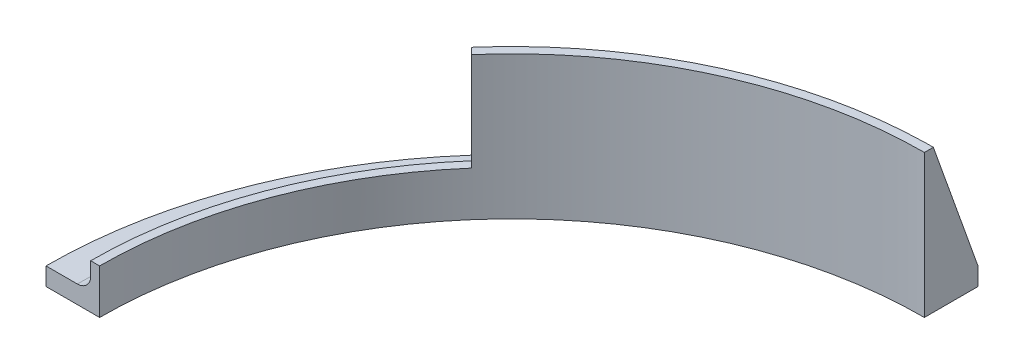
ISO-10303-21;
HEADER;
FILE_DESCRIPTION(('STEP AP214'),'2;1');
FILE_NAME('part.step','',(''),(''),'','','');
FILE_SCHEMA(('AUTOMOTIVE_DESIGN { 1 0 10303 214 1 1 1 1 }'));
ENDSEC;
DATA;
#1=APPLICATION_CONTEXT('core data for automotive mechanical design processes');
#2=APPLICATION_PROTOCOL_DEFINITION('international standard','automotive_design',2000,#1);
#3=PRODUCT_CONTEXT('',#1,'mechanical');
#4=PRODUCT('Part','Part','',(#3));
#5=PRODUCT_RELATED_PRODUCT_CATEGORY('part','',(#4));
#6=PRODUCT_DEFINITION_FORMATION('','',#4);
#7=PRODUCT_DEFINITION_CONTEXT('part definition',#1,'design');
#8=PRODUCT_DEFINITION('design','',#6,#7);
#9=PRODUCT_DEFINITION_SHAPE('','',#8);
#10=(LENGTH_UNIT() NAMED_UNIT(*) SI_UNIT(.MILLI.,.METRE.));
#11=(NAMED_UNIT(*) PLANE_ANGLE_UNIT() SI_UNIT($,.RADIAN.));
#12=(NAMED_UNIT(*) SI_UNIT($,.STERADIAN.) SOLID_ANGLE_UNIT());
#13=UNCERTAINTY_MEASURE_WITH_UNIT(LENGTH_MEASURE(1.E-05),#10,'distance_accuracy_value','');
#14=(GEOMETRIC_REPRESENTATION_CONTEXT(3) GLOBAL_UNCERTAINTY_ASSIGNED_CONTEXT((#13)) GLOBAL_UNIT_ASSIGNED_CONTEXT((#10,
#11,#12)) REPRESENTATION_CONTEXT('',''));
#15=CARTESIAN_POINT('',(0.,0.,0.));
#16=DIRECTION('',(0.,0.,1.));
#17=DIRECTION('',(1.,0.,0.));
#18=AXIS2_PLACEMENT_3D('',#15,#16,#17);
#19=CARTESIAN_POINT('',(0.,6.35,0.));
#20=DIRECTION('',(0.,1.,0.));
#21=DIRECTION('',(0.,0.,1.));
#22=AXIS2_PLACEMENT_3D('',#19,#20,#21);
#23=PLANE('',#22);
#24=CARTESIAN_POINT('',(-143.383000088422,6.35,-65.5843110499279));
#25=DIRECTION('',(0.,1.,0.));
#26=DIRECTION('',(0.,0.,1.));
#27=AXIS2_PLACEMENT_3D('',#24,#25,#26);
#28=CIRCLE('',#27,2.0193);
#29=CARTESIAN_POINT('',(-143.383000088422,6.35,-63.5650110499279));
#30=VERTEX_POINT('',#29);
#31=EDGE_CURVE('E246',#30,#30,#28,.T.);
#32=ORIENTED_EDGE('',*,*,#31,.F.);
#33=EDGE_LOOP('',(#32));
#34=FACE_BOUND('',#33,.T.);
#35=DIRECTION('',(-1.,0.,0.));
#36=VECTOR('',#35,1.);
#37=CARTESIAN_POINT('',(-146.558,6.35,0.));
#38=LINE('',#37,#36);
#39=CARTESIAN_POINT('',(-154.4955,6.35,0.));
#40=VERTEX_POINT('',#39);
#41=CARTESIAN_POINT('',(-165.608,6.35,0.));
#42=VERTEX_POINT('',#41);
#43=EDGE_CURVE('E285',#40,#42,#38,.T.);
#44=ORIENTED_EDGE('',*,*,#43,.F.);
#45=CARTESIAN_POINT('',(0.,6.35,0.));
#46=DIRECTION('',(0.,1.,0.));
#47=DIRECTION('',(0.,0.,1.));
#48=AXIS2_PLACEMENT_3D('',#45,#46,#47);
#49=CIRCLE('',#48,154.4955);
#50=CARTESIAN_POINT('',(-115.80414073816,6.35,-102.265636985971));
#51=VERTEX_POINT('',#50);
#52=EDGE_CURVE('E318',#40,#51,#49,.F.);
#53=ORIENTED_EDGE('',*,*,#52,.T.);
#54=DIRECTION('',(-0.735801674200395,0.,-0.677197088183267));
#55=VECTOR('',#54,1.);
#56=CARTESIAN_POINT('',(-109.987722522443,6.35,-96.9124805343771));
#57=LINE('',#56,#55);
#58=CARTESIAN_POINT('',(-123.982348087126,6.35,-109.792472541622));
#59=VERTEX_POINT('',#58);
#60=EDGE_CURVE('E186',#51,#59,#57,.T.);
#61=ORIENTED_EDGE('',*,*,#60,.T.);
#62=CARTESIAN_POINT('',(0.,6.35,0.));
#63=DIRECTION('',(0.,1.,0.));
#64=DIRECTION('',(0.,0.,1.));
#65=AXIS2_PLACEMENT_3D('',#62,#63,#64);
#66=CIRCLE('',#65,165.608);
#67=EDGE_CURVE('E287',#59,#42,#66,.T.);
#68=ORIENTED_EDGE('',*,*,#67,.T.);
#69=EDGE_LOOP('',(#44,#53,#61,#68));
#70=FACE_BOUND('',#69,.T.);
#71=ADVANCED_FACE('F61',(#34,#70),#23,.T.);
#72=CARTESIAN_POINT('',(0.,50.8,0.));
#73=DIRECTION('',(0.,-1.,0.));
#74=DIRECTION('',(0.,0.,-1.));
#75=AXIS2_PLACEMENT_3D('',#72,#73,#74);
#76=CYLINDRICAL_SURFACE('',#75,149.733);
#77=DIRECTION('',(0.,-1.,0.));
#78=VECTOR('',#77,1.);
#79=CARTESIAN_POINT('',(-112.299121496045,50.8,-99.0397829168485));
#80=LINE('',#79,#78);
#81=CARTESIAN_POINT('',(-112.299121496045,11.1125,-99.0397829168485));
#82=VERTEX_POINT('',#81);
#83=CARTESIAN_POINT('',(-112.299121496045,50.8,-99.0397829168485));
#84=VERTEX_POINT('',#83);
#85=EDGE_CURVE('E210',#82,#84,#80,.F.);
#86=ORIENTED_EDGE('',*,*,#85,.F.);
#87=CARTESIAN_POINT('',(0.,11.1125,0.));
#88=DIRECTION('',(0.,1.,0.));
#89=DIRECTION('',(0.,0.,1.));
#90=AXIS2_PLACEMENT_3D('',#87,#88,#89);
#91=CIRCLE('',#90,149.733);
#92=CARTESIAN_POINT('',(-149.733,11.1125,0.));
#93=VERTEX_POINT('',#92);
#94=EDGE_CURVE('E315',#82,#93,#91,.T.);
#95=ORIENTED_EDGE('',*,*,#94,.T.);
#96=DIRECTION('',(0.,-1.,0.));
#97=VECTOR('',#96,1.);
#98=CARTESIAN_POINT('',(-149.733,50.8,0.));
#99=LINE('',#98,#97);
#100=CARTESIAN_POINT('',(-149.733,15.875,0.));
#101=VERTEX_POINT('',#100);
#102=EDGE_CURVE('E278',#101,#93,#99,.T.);
#103=ORIENTED_EDGE('',*,*,#102,.F.);
#104=CARTESIAN_POINT('',(0.,15.875,0.));
#105=DIRECTION('',(0.,1.,0.));
#106=DIRECTION('',(0.,0.,1.));
#107=AXIS2_PLACEMENT_3D('',#104,#105,#106);
#108=CIRCLE('',#107,149.733);
#109=CARTESIAN_POINT('',(-112.817404434217,15.875,-98.448994640506));
#110=VERTEX_POINT('',#109);
#111=EDGE_CURVE('E253',#101,#110,#108,.F.);
#112=ORIENTED_EDGE('',*,*,#111,.T.);
#113=DIRECTION('',(0.,1.,0.));
#114=VECTOR('',#113,1.);
#115=CARTESIAN_POINT('',(-112.817404434217,-99.6036542990722,-98.448994640506));
#116=LINE('',#115,#114);
#117=CARTESIAN_POINT('',(-112.817404434217,50.8,-98.448994640506));
#118=VERTEX_POINT('',#117);
#119=EDGE_CURVE('E257',#110,#118,#116,.T.);
#120=ORIENTED_EDGE('',*,*,#119,.T.);
#121=CARTESIAN_POINT('',(0.,50.8,0.));
#122=DIRECTION('',(0.,1.,0.));
#123=DIRECTION('',(0.,0.,-1.));
#124=AXIS2_PLACEMENT_3D('',#121,#122,#123);
#125=CIRCLE('',#124,149.733);
#126=EDGE_CURVE('E273',#84,#118,#125,.T.);
#127=ORIENTED_EDGE('',*,*,#126,.F.);
#128=EDGE_LOOP('',(#86,#95,#103,#112,#120,#127));
#129=FACE_BOUND('',#128,.T.);
#130=ADVANCED_FACE('F386',(#129),#76,.T.);
#131=DIRECTION('',(-0.735801674200395,0.,-0.677197088183267));
#132=VECTOR('',#131,1.);
#133=CARTESIAN_POINT('',(-107.837621767461,6.35,-99.2486508499633));
#134=LINE('',#133,#132);
#135=CARTESIAN_POINT('',(-113.678047556427,6.35,-104.623902737418));
#136=VERTEX_POINT('',#135);
#137=CARTESIAN_POINT('',(-121.854643660979,6.35,-112.149255379855));
#138=VERTEX_POINT('',#137);
#139=EDGE_CURVE('E204',#136,#138,#134,.T.);
#140=ORIENTED_EDGE('',*,*,#139,.F.);
#141=CARTESIAN_POINT('',(0.,6.35,0.));
#142=DIRECTION('',(0.,1.,0.));
#143=DIRECTION('',(0.,0.,1.));
#144=AXIS2_PLACEMENT_3D('',#141,#142,#143);
#145=CIRCLE('',#144,154.4955);
#146=CARTESIAN_POINT('',(-3.175,6.35,-154.462872222583));
#147=VERTEX_POINT('',#146);
#148=EDGE_CURVE('E77',#136,#147,#145,.F.);
#149=ORIENTED_EDGE('',*,*,#148,.T.);
#150=DIRECTION('',(0.,0.,-1.));
#151=VECTOR('',#150,1.);
#152=CARTESIAN_POINT('',(-3.175,6.35,-146.558));
#153=LINE('',#152,#151);
#154=CARTESIAN_POINT('',(-3.175,6.35,-165.577562003431));
#155=VERTEX_POINT('',#154);
#156=EDGE_CURVE('E219',#147,#155,#153,.T.);
#157=ORIENTED_EDGE('',*,*,#156,.T.);
#158=EDGE_CURVE('E286',#155,#138,#66,.T.);
#159=ORIENTED_EDGE('',*,*,#158,.T.);
#160=EDGE_LOOP('',(#140,#149,#157,#159));
#161=FACE_BOUND('',#160,.T.);
#162=CARTESIAN_POINT('',(-6.35,6.35,-157.542578594645));
#163=DIRECTION('',(0.,1.,0.));
#164=DIRECTION('',(0.,0.,1.));
#165=AXIS2_PLACEMENT_3D('',#162,#163,#164);
#166=CIRCLE('',#165,2.01929999999999);
#167=CARTESIAN_POINT('',(-6.35,6.35,-155.523278594645));
#168=VERTEX_POINT('',#167);
#169=EDGE_CURVE('E233',#168,#168,#166,.T.);
#170=ORIENTED_EDGE('',*,*,#169,.F.);
#171=EDGE_LOOP('',(#170));
#172=FACE_BOUND('',#171,.T.);
#173=CARTESIAN_POINT('',(-87.8582584127768,6.35,-130.923309608808));
#174=DIRECTION('',(0.,1.,0.));
#175=DIRECTION('',(0.,0.,1.));
#176=AXIS2_PLACEMENT_3D('',#173,#174,#175);
#177=CIRCLE('',#176,2.01929999999999);
#178=CARTESIAN_POINT('',(-87.8582584127768,6.35,-128.904009608808));
#179=VERTEX_POINT('',#178);
#180=EDGE_CURVE('E240',#179,#179,#177,.T.);
#181=ORIENTED_EDGE('',*,*,#180,.F.);
#182=EDGE_LOOP('',(#181));
#183=FACE_BOUND('',#182,.T.);
#184=ADVANCED_FACE('F371',(#161,#172,#183),#23,.T.);
#185=DIRECTION('',(0.,-1.,0.));
#186=VECTOR('',#185,1.);
#187=CARTESIAN_POINT('',(-3.175,50.8,-149.699334213616));
#188=LINE('',#187,#186);
#189=CARTESIAN_POINT('',(-3.175,11.1125,-149.699334213616));
#190=VERTEX_POINT('',#189);
#191=CARTESIAN_POINT('',(-3.175,50.8,-149.699334213616));
#192=VERTEX_POINT('',#191);
#193=EDGE_CURVE('E229',#190,#192,#188,.F.);
#194=ORIENTED_EDGE('',*,*,#193,.F.);
#195=CARTESIAN_POINT('',(0.,11.1125,0.));
#196=DIRECTION('',(0.,1.,0.));
#197=DIRECTION('',(0.,0.,1.));
#198=AXIS2_PLACEMENT_3D('',#195,#196,#197);
#199=CIRCLE('',#198,149.733);
#200=CARTESIAN_POINT('',(-110.173792083048,11.1125,-101.398751604945));
#201=VERTEX_POINT('',#200);
#202=EDGE_CURVE('E327',#190,#201,#199,.T.);
#203=ORIENTED_EDGE('',*,*,#202,.T.);
#204=DIRECTION('',(0.,-1.,0.));
#205=VECTOR('',#204,1.);
#206=CARTESIAN_POINT('',(-110.173792083048,50.8,-101.398751604945));
#207=LINE('',#206,#205);
#208=CARTESIAN_POINT('',(-110.173792083048,50.8,-101.398751604945));
#209=VERTEX_POINT('',#208);
#210=EDGE_CURVE('E207',#201,#209,#207,.F.);
#211=ORIENTED_EDGE('',*,*,#210,.T.);
#212=EDGE_CURVE('E274',#192,#209,#125,.T.);
#213=ORIENTED_EDGE('',*,*,#212,.F.);
#214=EDGE_LOOP('',(#194,#203,#211,#213));
#215=FACE_BOUND('',#214,.T.);
#216=ADVANCED_FACE('F360',(#215),#76,.T.);
#217=CARTESIAN_POINT('',(-146.558,6.35,0.));
#218=DIRECTION('',(0.,0.,1.));
#219=DIRECTION('',(1.,0.,0.));
#220=AXIS2_PLACEMENT_3D('',#217,#218,#219);
#221=PLANE('',#220);
#222=DIRECTION('',(0.,-1.,0.));
#223=VECTOR('',#222,1.);
#224=CARTESIAN_POINT('',(-146.558,6.35,0.));
#225=LINE('',#224,#223);
#226=CARTESIAN_POINT('',(-146.558,15.875,0.));
#227=VERTEX_POINT('',#226);
#228=CARTESIAN_POINT('',(-146.558,0.,0.));
#229=VERTEX_POINT('',#228);
#230=EDGE_CURVE('E305',#227,#229,#225,.T.);
#231=ORIENTED_EDGE('',*,*,#230,.F.);
#232=DIRECTION('',(-1.,0.,0.));
#233=VECTOR('',#232,1.);
#234=CARTESIAN_POINT('',(-146.558,15.875,0.));
#235=LINE('',#234,#233);
#236=EDGE_CURVE('E256',#227,#101,#235,.T.);
#237=ORIENTED_EDGE('',*,*,#236,.T.);
#238=ORIENTED_EDGE('',*,*,#102,.T.);
#239=CARTESIAN_POINT('',(-154.4955,11.1125,0.));
#240=DIRECTION('',(0.,0.,1.));
#241=DIRECTION('',(1.,0.,0.));
#242=AXIS2_PLACEMENT_3D('',#239,#240,#241);
#243=CIRCLE('',#242,4.7625);
#244=EDGE_CURVE('E13',#93,#40,#243,.F.);
#245=ORIENTED_EDGE('',*,*,#244,.T.);
#246=ORIENTED_EDGE('',*,*,#43,.T.);
#247=DIRECTION('',(0.,-1.,0.));
#248=VECTOR('',#247,1.);
#249=CARTESIAN_POINT('',(-165.608,6.35,0.));
#250=LINE('',#249,#248);
#251=CARTESIAN_POINT('',(-165.608,0.,0.));
#252=VERTEX_POINT('',#251);
#253=EDGE_CURVE('E307',#42,#252,#250,.T.);
#254=ORIENTED_EDGE('',*,*,#253,.T.);
#255=DIRECTION('',(-1.,0.,0.));
#256=VECTOR('',#255,1.);
#257=CARTESIAN_POINT('',(-146.558,0.,0.));
#258=LINE('',#257,#256);
#259=EDGE_CURVE('E296',#229,#252,#258,.T.);
#260=ORIENTED_EDGE('',*,*,#259,.F.);
#261=EDGE_LOOP('',(#231,#237,#238,#245,#246,#254,#260));
#262=FACE_BOUND('',#261,.T.);
#263=ADVANCED_FACE('F379',(#262),#221,.T.);
#264=CARTESIAN_POINT('',(0.,6.35,-146.558));
#265=DIRECTION('',(-1.,0.,0.));
#266=DIRECTION('',(0.,0.,1.));
#267=AXIS2_PLACEMENT_3D('',#264,#265,#266);
#268=PLANE('',#267);
#269=DIRECTION('',(0.,-1.,0.));
#270=VECTOR('',#269,1.);
#271=CARTESIAN_POINT('',(0.,6.35,-146.558));
#272=LINE('',#271,#270);
#273=CARTESIAN_POINT('',(0.,50.8,-146.558));
#274=VERTEX_POINT('',#273);
#275=CARTESIAN_POINT('',(0.,0.,-146.558));
#276=VERTEX_POINT('',#275);
#277=EDGE_CURVE('E289',#274,#276,#272,.T.);
#278=ORIENTED_EDGE('',*,*,#277,.T.);
#279=DIRECTION('',(0.,0.,-1.));
#280=VECTOR('',#279,1.);
#281=CARTESIAN_POINT('',(0.,0.,-146.558));
#282=LINE('',#281,#280);
#283=CARTESIAN_POINT('',(0.,0.,-165.608));
#284=VERTEX_POINT('',#283);
#285=EDGE_CURVE('E281',#276,#284,#282,.T.);
#286=ORIENTED_EDGE('',*,*,#285,.T.);
#287=DIRECTION('',(0.,-1.,0.));
#288=VECTOR('',#287,1.);
#289=CARTESIAN_POINT('',(0.,6.35,-165.608));
#290=LINE('',#289,#288);
#291=CARTESIAN_POINT('',(0.,6.35,-165.608));
#292=VERTEX_POINT('',#291);
#293=EDGE_CURVE('E309',#292,#284,#290,.T.);
#294=ORIENTED_EDGE('',*,*,#293,.F.);
#295=DIRECTION('',(0.,0.941741911594838,0.336336396998156));
#296=VECTOR('',#295,1.);
#297=CARTESIAN_POINT('',(0.,50.8,-149.733));
#298=LINE('',#297,#296);
#299=CARTESIAN_POINT('',(0.,50.8,-149.733));
#300=VERTEX_POINT('',#299);
#301=EDGE_CURVE('E213',#292,#300,#298,.T.);
#302=ORIENTED_EDGE('',*,*,#301,.T.);
#303=DIRECTION('',(0.,0.,-1.));
#304=VECTOR('',#303,1.);
#305=CARTESIAN_POINT('',(0.,50.8,-146.558));
#306=LINE('',#305,#304);
#307=EDGE_CURVE('E271',#274,#300,#306,.T.);
#308=ORIENTED_EDGE('',*,*,#307,.F.);
#309=EDGE_LOOP('',(#278,#286,#294,#302,#308));
#310=FACE_BOUND('',#309,.T.);
#311=ADVANCED_FACE('F418',(#310),#268,.F.);
#312=CARTESIAN_POINT('',(0.,6.35,0.));
#313=DIRECTION('',(0.,-1.,0.));
#314=DIRECTION('',(0.,0.,-1.));
#315=AXIS2_PLACEMENT_3D('',#312,#313,#314);
#316=CYLINDRICAL_SURFACE('',#315,165.608);
#317=CARTESIAN_POINT('',(0.,0.,0.));
#318=DIRECTION('',(0.,1.,0.));
#319=DIRECTION('',(0.,0.,1.));
#320=AXIS2_PLACEMENT_3D('',#317,#318,#319);
#321=CIRCLE('',#320,165.608);
#322=EDGE_CURVE('E293',#284,#252,#321,.T.);
#323=ORIENTED_EDGE('',*,*,#322,.T.);
#324=ORIENTED_EDGE('',*,*,#253,.F.);
#325=ORIENTED_EDGE('',*,*,#67,.F.);
#326=CARTESIAN_POINT('',(0.,6.35000000000001,0.));
#327=DIRECTION('',(0.,-1.,0.));
#328=DIRECTION('',(1.,0.,0.));
#329=AXIS2_PLACEMENT_3D('',#326,#327,#328);
#330=CIRCLE('',#329,165.608);
#331=EDGE_CURVE('E182',#59,#138,#330,.T.);
#332=ORIENTED_EDGE('',*,*,#331,.T.);
#333=ORIENTED_EDGE('',*,*,#158,.F.);
#334=EDGE_CURVE('E282',#292,#155,#66,.T.);
#335=ORIENTED_EDGE('',*,*,#334,.F.);
#336=ORIENTED_EDGE('',*,*,#293,.T.);
#337=EDGE_LOOP('',(#323,#324,#325,#332,#333,#335,#336));
#338=FACE_BOUND('',#337,.T.);
#339=ADVANCED_FACE('F368',(#338),#316,.T.);
#340=CARTESIAN_POINT('',(0.,6.35,0.));
#341=DIRECTION('',(0.,-1.,0.));
#342=DIRECTION('',(0.,0.,-1.));
#343=AXIS2_PLACEMENT_3D('',#340,#341,#342);
#344=CYLINDRICAL_SURFACE('',#343,146.558);
#345=ORIENTED_EDGE('',*,*,#277,.F.);
#346=CARTESIAN_POINT('',(0.,50.8,0.));
#347=DIRECTION('',(0.,-1.,0.));
#348=DIRECTION('',(0.,0.,-1.));
#349=AXIS2_PLACEMENT_3D('',#346,#347,#348);
#350=CIRCLE('',#349,146.558);
#351=CARTESIAN_POINT('',(-110.567041393055,50.8,-96.1986315993446));
#352=VERTEX_POINT('',#351);
#353=EDGE_CURVE('E265',#352,#274,#350,.T.);
#354=ORIENTED_EDGE('',*,*,#353,.F.);
#355=DIRECTION('',(0.,1.,0.));
#356=VECTOR('',#355,1.);
#357=CARTESIAN_POINT('',(-110.567041393055,-99.6036542990722,-96.1986315993446));
#358=LINE('',#357,#356);
#359=CARTESIAN_POINT('',(-110.567041393055,15.875,-96.1986315993446));
#360=VERTEX_POINT('',#359);
#361=EDGE_CURVE('E252',#360,#352,#358,.T.);
#362=ORIENTED_EDGE('',*,*,#361,.F.);
#363=CARTESIAN_POINT('',(0.,15.875,0.));
#364=DIRECTION('',(0.,1.,0.));
#365=DIRECTION('',(0.,0.,1.));
#366=AXIS2_PLACEMENT_3D('',#363,#364,#365);
#367=CIRCLE('',#366,146.558);
#368=EDGE_CURVE('E260',#360,#227,#367,.T.);
#369=ORIENTED_EDGE('',*,*,#368,.T.);
#370=ORIENTED_EDGE('',*,*,#230,.T.);
#371=CARTESIAN_POINT('',(0.,0.,0.));
#372=DIRECTION('',(0.,1.,0.));
#373=DIRECTION('',(0.,0.,1.));
#374=AXIS2_PLACEMENT_3D('',#371,#372,#373);
#375=CIRCLE('',#374,146.558);
#376=EDGE_CURVE('E299',#276,#229,#375,.T.);
#377=ORIENTED_EDGE('',*,*,#376,.F.);
#378=EDGE_LOOP('',(#345,#354,#362,#369,#370,#377));
#379=FACE_BOUND('',#378,.T.);
#380=ADVANCED_FACE('F495',(#379),#344,.F.);
#381=CARTESIAN_POINT('',(0.,0.,0.));
#382=DIRECTION('',(0.,1.,0.));
#383=DIRECTION('',(0.,0.,1.));
#384=AXIS2_PLACEMENT_3D('',#381,#382,#383);
#385=PLANE('',#384);
#386=CARTESIAN_POINT('',(-6.35,0.,-157.542578594645));
#387=DIRECTION('',(0.,1.,0.));
#388=DIRECTION('',(0.,0.,1.));
#389=AXIS2_PLACEMENT_3D('',#386,#387,#388);
#390=CIRCLE('',#389,2.01929999999999);
#391=CARTESIAN_POINT('',(-6.35,0.,-155.523278594645));
#392=VERTEX_POINT('',#391);
#393=EDGE_CURVE('E236',#392,#392,#390,.T.);
#394=ORIENTED_EDGE('',*,*,#393,.T.);
#395=EDGE_LOOP('',(#394));
#396=FACE_BOUND('',#395,.T.);
#397=CARTESIAN_POINT('',(-87.8582584127768,0.,-130.923309608808));
#398=DIRECTION('',(0.,1.,0.));
#399=DIRECTION('',(0.,0.,1.));
#400=AXIS2_PLACEMENT_3D('',#397,#398,#399);
#401=CIRCLE('',#400,2.01929999999999);
#402=CARTESIAN_POINT('',(-87.8582584127768,0.,-128.904009608808));
#403=VERTEX_POINT('',#402);
#404=EDGE_CURVE('E243',#403,#403,#401,.T.);
#405=ORIENTED_EDGE('',*,*,#404,.T.);
#406=EDGE_LOOP('',(#405));
#407=FACE_BOUND('',#406,.T.);
#408=CARTESIAN_POINT('',(-143.383000088422,0.,-65.5843110499279));
#409=DIRECTION('',(0.,1.,0.));
#410=DIRECTION('',(0.,0.,1.));
#411=AXIS2_PLACEMENT_3D('',#408,#409,#410);
#412=CIRCLE('',#411,2.0193);
#413=CARTESIAN_POINT('',(-143.383000088422,0.,-63.5650110499279));
#414=VERTEX_POINT('',#413);
#415=EDGE_CURVE('E249',#414,#414,#412,.T.);
#416=ORIENTED_EDGE('',*,*,#415,.T.);
#417=EDGE_LOOP('',(#416));
#418=FACE_BOUND('',#417,.T.);
#419=ORIENTED_EDGE('',*,*,#285,.F.);
#420=ORIENTED_EDGE('',*,*,#376,.T.);
#421=ORIENTED_EDGE('',*,*,#259,.T.);
#422=ORIENTED_EDGE('',*,*,#322,.F.);
#423=EDGE_LOOP('',(#419,#420,#421,#422));
#424=FACE_BOUND('',#423,.T.);
#425=ADVANCED_FACE('F424',(#396,#407,#418,#424),#385,.F.);
#426=CARTESIAN_POINT('',(0.,50.8,0.));
#427=DIRECTION('',(0.,-1.,0.));
#428=DIRECTION('',(0.,0.,-1.));
#429=AXIS2_PLACEMENT_3D('',#426,#427,#428);
#430=PLANE('',#429);
#431=ORIENTED_EDGE('',*,*,#212,.T.);
#432=DIRECTION('',(0.677197088183267,0.,-0.735801674200395));
#433=VECTOR('',#432,1.);
#434=CARTESIAN_POINT('',(-112.32389283803,50.8,-99.0625812893589));
#435=LINE('',#434,#433);
#436=CARTESIAN_POINT('',(-112.32389283803,50.8,-99.0625812893589));
#437=VERTEX_POINT('',#436);
#438=EDGE_CURVE('E196',#437,#209,#435,.T.);
#439=ORIENTED_EDGE('',*,*,#438,.F.);
#440=DIRECTION('',(0.735801674200395,0.,0.677197088183267));
#441=VECTOR('',#440,1.);
#442=CARTESIAN_POINT('',(-112.32389283803,50.8,-99.0625812893589));
#443=LINE('',#442,#441);
#444=EDGE_CURVE('E187',#437,#84,#443,.T.);
#445=ORIENTED_EDGE('',*,*,#444,.T.);
#446=ORIENTED_EDGE('',*,*,#126,.T.);
#447=DIRECTION('',(0.707106781186547,0.,0.707106781186547));
#448=VECTOR('',#447,1.);
#449=CARTESIAN_POINT('',(-112.817404434217,50.8,-98.448994640506));
#450=LINE('',#449,#448);
#451=EDGE_CURVE('E312',#118,#352,#450,.T.);
#452=ORIENTED_EDGE('',*,*,#451,.T.);
#453=ORIENTED_EDGE('',*,*,#353,.T.);
#454=ORIENTED_EDGE('',*,*,#307,.T.);
#455=DIRECTION('',(1.,0.,0.));
#456=VECTOR('',#455,1.);
#457=CARTESIAN_POINT('',(-3.175,50.8,-149.733));
#458=LINE('',#457,#456);
#459=CARTESIAN_POINT('',(-3.175,50.8,-149.733));
#460=VERTEX_POINT('',#459);
#461=EDGE_CURVE('E226',#460,#300,#458,.T.);
#462=ORIENTED_EDGE('',*,*,#461,.F.);
#463=DIRECTION('',(0.,0.,1.));
#464=VECTOR('',#463,1.);
#465=CARTESIAN_POINT('',(-3.175,50.8,-149.733));
#466=LINE('',#465,#464);
#467=EDGE_CURVE('E214',#460,#192,#466,.T.);
#468=ORIENTED_EDGE('',*,*,#467,.T.);
#469=EDGE_LOOP('',(#431,#439,#445,#446,#452,#453,#454,#462,#468));
#470=FACE_BOUND('',#469,.T.);
#471=ADVANCED_FACE('F390',(#470),#430,.F.);
#472=CARTESIAN_POINT('',(-112.817404434217,-99.6036542990722,-98.448994640506));
#473=DIRECTION('',(0.707106781186548,0.,-0.707106781186548));
#474=DIRECTION('',(-0.707106781186548,0.,-0.707106781186548));
#475=AXIS2_PLACEMENT_3D('',#472,#473,#474);
#476=PLANE('',#475);
#477=ORIENTED_EDGE('',*,*,#119,.F.);
#478=DIRECTION('',(0.707106781186548,0.,0.707106781186548));
#479=VECTOR('',#478,1.);
#480=CARTESIAN_POINT('',(-112.817404434217,15.875,-98.448994640506));
#481=LINE('',#480,#479);
#482=EDGE_CURVE('E263',#110,#360,#481,.T.);
#483=ORIENTED_EDGE('',*,*,#482,.T.);
#484=ORIENTED_EDGE('',*,*,#361,.T.);
#485=ORIENTED_EDGE('',*,*,#451,.F.);
#486=EDGE_LOOP('',(#477,#483,#484,#485));
#487=FACE_BOUND('',#486,.T.);
#488=ADVANCED_FACE('F423',(#487),#476,.F.);
#489=CARTESIAN_POINT('',(0.,15.875,0.));
#490=DIRECTION('',(0.,1.,0.));
#491=DIRECTION('',(0.,0.,1.));
#492=AXIS2_PLACEMENT_3D('',#489,#490,#491);
#493=PLANE('',#492);
#494=ORIENTED_EDGE('',*,*,#368,.F.);
#495=ORIENTED_EDGE('',*,*,#482,.F.);
#496=ORIENTED_EDGE('',*,*,#111,.F.);
#497=ORIENTED_EDGE('',*,*,#236,.F.);
#498=EDGE_LOOP('',(#494,#495,#496,#497));
#499=FACE_BOUND('',#498,.T.);
#500=ADVANCED_FACE('F427',(#499),#493,.T.);
#501=CARTESIAN_POINT('',(-143.383000088422,6.35,-65.5843110499279));
#502=DIRECTION('',(0.,1.,0.));
#503=DIRECTION('',(0.,0.,1.));
#504=AXIS2_PLACEMENT_3D('',#501,#502,#503);
#505=CYLINDRICAL_SURFACE('',#504,2.0193);
#506=ORIENTED_EDGE('',*,*,#415,.F.);
#507=EDGE_LOOP('',(#506));
#508=FACE_BOUND('',#507,.T.);
#509=ORIENTED_EDGE('',*,*,#31,.T.);
#510=EDGE_LOOP('',(#509));
#511=FACE_BOUND('',#510,.T.);
#512=ADVANCED_FACE('F431',(#508,#511),#505,.F.);
#513=CARTESIAN_POINT('',(-87.8582584127768,6.35,-130.923309608808));
#514=DIRECTION('',(0.,1.,0.));
#515=DIRECTION('',(0.,0.,1.));
#516=AXIS2_PLACEMENT_3D('',#513,#514,#515);
#517=CYLINDRICAL_SURFACE('',#516,2.01929999999999);
#518=ORIENTED_EDGE('',*,*,#404,.F.);
#519=EDGE_LOOP('',(#518));
#520=FACE_BOUND('',#519,.T.);
#521=ORIENTED_EDGE('',*,*,#180,.T.);
#522=EDGE_LOOP('',(#521));
#523=FACE_BOUND('',#522,.T.);
#524=ADVANCED_FACE('F435',(#520,#523),#517,.F.);
#525=CARTESIAN_POINT('',(-6.35,6.35,-157.542578594645));
#526=DIRECTION('',(0.,1.,0.));
#527=DIRECTION('',(0.,0.,1.));
#528=AXIS2_PLACEMENT_3D('',#525,#526,#527);
#529=CYLINDRICAL_SURFACE('',#528,2.01929999999999);
#530=ORIENTED_EDGE('',*,*,#393,.F.);
#531=EDGE_LOOP('',(#530));
#532=FACE_BOUND('',#531,.T.);
#533=ORIENTED_EDGE('',*,*,#169,.T.);
#534=EDGE_LOOP('',(#533));
#535=FACE_BOUND('',#534,.T.);
#536=ADVANCED_FACE('F348',(#532,#535),#529,.F.);
#537=CARTESIAN_POINT('',(-3.175,0.,0.));
#538=DIRECTION('',(1.,0.,0.));
#539=DIRECTION('',(0.,0.,-1.));
#540=AXIS2_PLACEMENT_3D('',#537,#538,#539);
#541=PLANE('',#540);
#542=ORIENTED_EDGE('',*,*,#156,.F.);
#543=CARTESIAN_POINT('',(-3.175,6.35,-154.462872222583));
#544=CARTESIAN_POINT('',(-3.175,6.34998561083751,-154.328871862332));
#545=CARTESIAN_POINT('',(-3.175,6.3556524711361,-154.194873562937));
#546=CARTESIAN_POINT('',(-3.175,6.37824473109358,-153.927835550644));
#547=CARTESIAN_POINT('',(-3.175,6.39516959482576,-153.794795792421));
#548=CARTESIAN_POINT('',(-3.175,6.44015705348762,-153.530715400223));
#549=CARTESIAN_POINT('',(-3.175,6.4682112903981,-153.399673342514));
#550=CARTESIAN_POINT('',(-3.175,6.53525364159625,-153.140418501727));
#551=CARTESIAN_POINT('',(-3.175,6.57424162171378,-153.012205683951));
#552=CARTESIAN_POINT('',(-3.175,6.66288965316341,-152.75948018318));
#553=CARTESIAN_POINT('',(-3.175,6.71255294997489,-152.634968638568));
#554=CARTESIAN_POINT('',(-3.175,6.82221193125949,-152.390526428227));
#555=CARTESIAN_POINT('',(-3.175,6.88221142825427,-152.270597472806));
#556=CARTESIAN_POINT('',(-3.175,7.01206824421182,-152.036286664764));
#557=CARTESIAN_POINT('',(-3.175,7.08192015702928,-151.921901815964));
#558=CARTESIAN_POINT('',(-3.175,7.23103803570134,-151.699381271227));
#559=CARTESIAN_POINT('',(-3.175,7.31030745904072,-151.59124789221));
#560=CARTESIAN_POINT('',(-3.175,7.47763710066687,-151.38209460194));
#561=CARTESIAN_POINT('',(-3.175,7.56569317989976,-151.281071379258));
#562=CARTESIAN_POINT('',(-3.175,7.75003616355495,-151.08676480894));
#563=CARTESIAN_POINT('',(-3.175,7.8463261222045,-150.993484358869));
#564=CARTESIAN_POINT('',(-3.175,8.04640724614162,-150.815384389967));
#565=CARTESIAN_POINT('',(-3.175,8.15019714660891,-150.730563450205));
#566=CARTESIAN_POINT('',(-3.175,8.36459281208832,-150.56993976712));
#567=CARTESIAN_POINT('',(-3.175,8.47520098725735,-150.4941402408));
#568=CARTESIAN_POINT('',(-3.175,8.70239200628402,-150.352147755176));
#569=CARTESIAN_POINT('',(-3.175,8.81897372284634,-150.28595299228));
#570=CARTESIAN_POINT('',(-3.175,9.05730049181855,-150.163624428354));
#571=CARTESIAN_POINT('',(-3.175,9.1790455650599,-150.107490667921));
#572=CARTESIAN_POINT('',(-3.175,9.42677880605855,-150.005708497727));
#573=CARTESIAN_POINT('',(-3.175,9.55276489314114,-149.960055029801));
#574=CARTESIAN_POINT('',(-3.175,9.80808867545054,-149.87953437245));
#575=CARTESIAN_POINT('',(-3.175,9.93742563218312,-149.84466482792));
#576=CARTESIAN_POINT('',(-3.175,10.2393779856996,-149.776782829682));
#577=CARTESIAN_POINT('',(-3.175,10.4129117096064,-149.747740575515));
#578=CARTESIAN_POINT('',(-3.175,10.6746042765313,-149.718700074677));
#579=CARTESIAN_POINT('',(-3.175,10.7620231617278,-149.711440394137));
#580=CARTESIAN_POINT('',(-3.175,10.937120882336,-149.701758098451));
#581=CARTESIAN_POINT('',(-3.175,11.0247996947294,-149.699335067089));
#582=CARTESIAN_POINT('',(-3.175,11.1125,-149.699334213616));
#583=B_SPLINE_CURVE_WITH_KNOTS('',3,(#543,#544,#545,#546,#547,#548,#549,#550,#551,#552,#553,
#554,#555,#556,#557,#558,#559,#560,#561,#562,#563,#564,#565,#566,#567,#568,#569,#570,#571,#572,
#573,#574,#575,#576,#577,#578,#579,#580,#581,#582),.UNSPECIFIED.,.F.,.F.,(4,2,2,2,2,2,2,2,2,2,2,
2,2,2,2,2,2,2,2,4),(0.,0.401878404608353,0.803737679540477,1.20529573278991,1.6068488586561,
2.00852423665822,2.4103480916471,2.81195231240207,3.21370443387285,3.61526819093231,
4.01698155327088,4.41862732645775,4.82041589866111,5.22212892471142,5.62384357161908,
6.02536392704857,6.42679653224716,6.95341568837336,7.2164628840131,7.47948744221345),.UNSPECIFIED.);
#584=EDGE_CURVE('E70',#147,#190,#583,.T.);
#585=ORIENTED_EDGE('',*,*,#584,.T.);
#586=ORIENTED_EDGE('',*,*,#193,.T.);
#587=ORIENTED_EDGE('',*,*,#467,.F.);
#588=DIRECTION('',(0.,0.941741911594838,0.336336396998156));
#589=VECTOR('',#588,1.);
#590=CARTESIAN_POINT('',(-3.175,50.8,-149.733));
#591=LINE('',#590,#589);
#592=CARTESIAN_POINT('',(-3.175,6.35,-165.608));
#593=VERTEX_POINT('',#592);
#594=EDGE_CURVE('E220',#593,#460,#591,.T.);
#595=ORIENTED_EDGE('',*,*,#594,.F.);
#596=EDGE_CURVE('E217',#155,#593,#153,.T.);
#597=ORIENTED_EDGE('',*,*,#596,.F.);
#598=EDGE_LOOP('',(#542,#585,#586,#587,#595,#597));
#599=FACE_BOUND('',#598,.T.);
#600=ADVANCED_FACE('F343',(#599),#541,.F.);
#601=CARTESIAN_POINT('',(-3.175,50.8,-149.733));
#602=DIRECTION('',(0.,0.336336396998156,-0.941741911594838));
#603=DIRECTION('',(0.,0.941741911594838,0.336336396998156));
#604=AXIS2_PLACEMENT_3D('',#601,#602,#603);
#605=PLANE('',#604);
#606=ORIENTED_EDGE('',*,*,#301,.F.);
#607=DIRECTION('',(1.,0.,0.));
#608=VECTOR('',#607,1.);
#609=CARTESIAN_POINT('',(-3.175,6.35,-165.608));
#610=LINE('',#609,#608);
#611=EDGE_CURVE('E223',#593,#292,#610,.T.);
#612=ORIENTED_EDGE('',*,*,#611,.F.);
#613=ORIENTED_EDGE('',*,*,#594,.T.);
#614=ORIENTED_EDGE('',*,*,#461,.T.);
#615=EDGE_LOOP('',(#606,#612,#613,#614));
#616=FACE_BOUND('',#615,.T.);
#617=ADVANCED_FACE('F347',(#616),#605,.T.);
#618=CARTESIAN_POINT('',(-3.175,6.35,-146.558));
#619=DIRECTION('',(0.,-1.,0.));
#620=DIRECTION('',(0.,0.,-1.));
#621=AXIS2_PLACEMENT_3D('',#618,#619,#620);
#622=PLANE('',#621);
#623=ORIENTED_EDGE('',*,*,#334,.T.);
#624=ORIENTED_EDGE('',*,*,#596,.T.);
#625=ORIENTED_EDGE('',*,*,#611,.T.);
#626=EDGE_LOOP('',(#623,#624,#625));
#627=FACE_BOUND('',#626,.T.);
#628=ADVANCED_FACE('F336',(#627),#622,.T.);
#629=CARTESIAN_POINT('',(-2.15010075498187,0.,2.33617031558625));
#630=DIRECTION('',(0.677197088183267,0.,-0.735801674200395));
#631=DIRECTION('',(-0.735801674200395,0.,-0.677197088183267));
#632=AXIS2_PLACEMENT_3D('',#629,#630,#631);
#633=PLANE('',#632);
#634=ORIENTED_EDGE('',*,*,#60,.F.);
#635=CARTESIAN_POINT('',(-115.80414073816,6.35,-102.265636985971));
#636=CARTESIAN_POINT('',(-115.705543048744,6.34998561083751,-102.174892332194));
#637=CARTESIAN_POINT('',(-115.606946875709,6.35565247113611,-102.084149074022));
#638=CARTESIAN_POINT('',(-115.410459859188,6.37824473109359,-101.903311709662));
#639=CARTESIAN_POINT('',(-115.312568982353,6.39516959482576,-101.813217572781));
#640=CARTESIAN_POINT('',(-115.11825818765,6.44015705348763,-101.634383100139));
#641=CARTESIAN_POINT('',(-115.021837222198,6.4682112903981,-101.545641800229));
#642=CARTESIAN_POINT('',(-114.831077076302,6.53525364159625,-101.37007517695));
#643=CARTESIAN_POINT('',(-114.736737870328,6.57424162171378,-101.283249830085));
#644=CARTESIAN_POINT('',(-114.550782023748,6.66288965316341,-101.112104856853));
#645=CARTESIAN_POINT('',(-114.459166220765,6.71255294997489,-101.027786001396));
#646=CARTESIAN_POINT('',(-114.279305233151,6.82221193125949,-100.862250448324));
#647=CARTESIAN_POINT('',(-114.191061306967,6.88221142825428,-100.781034908925));
#648=CARTESIAN_POINT('',(-114.018655022126,7.01206824421183,-100.622360311988));
#649=CARTESIAN_POINT('',(-113.934490458876,7.08192015702927,-100.544899225449));
#650=CARTESIAN_POINT('',(-113.770759469515,7.23103803570133,-100.394208960492));
#651=CARTESIAN_POINT('',(-113.691194748197,7.31030745904073,-100.320981351086));
#652=CARTESIAN_POINT('',(-113.537299407052,7.47763710066688,-100.179343351932));
#653=CARTESIAN_POINT('',(-113.462966350669,7.56569317989976,-100.110930719692));
#654=CARTESIAN_POINT('',(-113.319995250921,7.75003616355495,-99.9793468760581));
#655=CARTESIAN_POINT('',(-113.251359339589,7.8463261222045,-99.9161776268857));
#656=CARTESIAN_POINT('',(-113.120313084295,8.04640724614162,-99.7955688465392));
#657=CARTESIAN_POINT('',(-113.057901694812,8.15019714660892,-99.738128353116));
#658=CARTESIAN_POINT('',(-112.939714519882,8.36459281208833,-99.6293544626376));
#659=CARTESIAN_POINT('',(-112.883941101512,8.47520098725736,-99.5780232441281));
#660=CARTESIAN_POINT('',(-112.779462792866,8.70239200628402,-99.4818663463193));
#661=CARTESIAN_POINT('',(-112.730756575503,8.81897372284634,-99.4370394456331));
#662=CARTESIAN_POINT('',(-112.640747013364,9.05730049181854,-99.3541988983411));
#663=CARTESIAN_POINT('',(-112.599443698458,9.17904556505989,-99.3161852792267));
#664=CARTESIAN_POINT('',(-112.524552207226,9.42677880605854,-99.2472586899424));
#665=CARTESIAN_POINT('',(-112.490960309092,9.55276489314113,-99.2163422943972));
#666=CARTESIAN_POINT('',(-112.431713074606,9.80808867545054,-99.1618139397007));
#667=CARTESIAN_POINT('',(-112.406056005362,9.93742563218311,-99.1382003856785));
#668=CARTESIAN_POINT('',(-112.356108317411,10.2393779856995,-99.0922308941323));
#669=CARTESIAN_POINT('',(-112.334738978172,10.4129117096063,-99.0725635641755));
#670=CARTESIAN_POINT('',(-112.313370929036,10.6746042765313,-99.0528974215691));
#671=CARTESIAN_POINT('',(-112.30802924394,10.7620231617278,-99.0479811870458));
#672=CARTESIAN_POINT('',(-112.300904994564,10.937120882336,-99.0414243646004));
#673=CARTESIAN_POINT('',(-112.299122124032,11.0247996947294,-99.0397834948176));
#674=CARTESIAN_POINT('',(-112.299121496045,11.1125,-99.0397829168485));
#675=B_SPLINE_CURVE_WITH_KNOTS('',3,(#635,#636,#637,#638,#639,#640,#641,#642,#643,#644,#645,
#646,#647,#648,#649,#650,#651,#652,#653,#654,#655,#656,#657,#658,#659,#660,#661,#662,#663,#664,
#665,#666,#667,#668,#669,#670,#671,#672,#673,#674),.UNSPECIFIED.,.F.,.F.,(4,2,2,2,2,2,2,2,2,2,2,
2,2,2,2,2,2,2,2,4),(0.,0.401878404608342,0.803737679540468,1.20529573278989,1.60684885865609,
2.00852423665822,2.41034809164708,2.81195231240204,3.21370443387282,3.61526819093229,
4.01698155327088,4.41862732645775,4.8204158986611,5.2221289247114,5.62384357161905,
6.02536392704854,6.42679653224713,6.95341568837333,7.21646288401307,7.47948744221342),.UNSPECIFIED.);
#676=EDGE_CURVE('E320',#51,#82,#675,.T.);
#677=ORIENTED_EDGE('',*,*,#676,.T.);
#678=ORIENTED_EDGE('',*,*,#85,.T.);
#679=ORIENTED_EDGE('',*,*,#444,.F.);
#680=DIRECTION('',(0.247476884005772,0.941741911594838,0.227766028697203));
#681=VECTOR('',#680,1.);
#682=CARTESIAN_POINT('',(-112.32389283803,50.8,-99.0625812893589));
#683=LINE('',#682,#681);
#684=CARTESIAN_POINT('',(-124.004744415961,6.35,-109.813085064268));
#685=VERTEX_POINT('',#684);
#686=EDGE_CURVE('E193',#685,#437,#683,.T.);
#687=ORIENTED_EDGE('',*,*,#686,.F.);
#688=EDGE_CURVE('E176',#59,#685,#57,.T.);
#689=ORIENTED_EDGE('',*,*,#688,.F.);
#690=EDGE_LOOP('',(#634,#677,#678,#679,#687,#689));
#691=FACE_BOUND('',#690,.T.);
#692=ADVANCED_FACE('F199',(#691),#633,.F.);
#693=CARTESIAN_POINT('',(0.,0.,0.));
#694=DIRECTION('',(0.677197088183267,0.,-0.735801674200395));
#695=DIRECTION('',(-0.735801674200395,0.,-0.677197088183267));
#696=AXIS2_PLACEMENT_3D('',#693,#694,#695);
#697=PLANE('',#696);
#698=ORIENTED_EDGE('',*,*,#210,.F.);
#699=CARTESIAN_POINT('',(-113.678047556427,11.1125,-104.623902737418));
#700=DIRECTION('',(0.677197088183267,0.,-0.735801674200395));
#701=DIRECTION('',(-0.735801674200395,0.,-0.677197088183267));
#702=AXIS2_PLACEMENT_3D('',#699,#700,#701);
#703=CIRCLE('',#702,4.7625);
#704=EDGE_CURVE('E85',#201,#136,#703,.T.);
#705=ORIENTED_EDGE('',*,*,#704,.T.);
#706=ORIENTED_EDGE('',*,*,#139,.T.);
#707=DIRECTION('',(0.247476884005772,0.941741911594838,0.227766028697203));
#708=VECTOR('',#707,1.);
#709=CARTESIAN_POINT('',(-110.173792083048,50.8,-101.398751604945));
#710=LINE('',#709,#708);
#711=EDGE_CURVE('E195',#138,#209,#710,.T.);
#712=ORIENTED_EDGE('',*,*,#711,.T.);
#713=EDGE_LOOP('',(#698,#705,#706,#712));
#714=FACE_BOUND('',#713,.T.);
#715=ADVANCED_FACE('F335',(#714),#697,.T.);
#716=CARTESIAN_POINT('',(-112.32389283803,50.8,-99.0625812893589));
#717=DIRECTION('',(-0.692935275216162,0.336336396998156,-0.637744880352168));
#718=DIRECTION('',(-0.677197088183267,0.,0.735801674200395));
#719=AXIS2_PLACEMENT_3D('',#716,#717,#718);
#720=PLANE('',#719);
#721=ORIENTED_EDGE('',*,*,#711,.F.);
#722=DIRECTION('',(0.677197088183267,0.,-0.735801674200395));
#723=VECTOR('',#722,1.);
#724=CARTESIAN_POINT('',(-124.004744415961,6.35,-109.813085064268));
#725=LINE('',#724,#723);
#726=EDGE_CURVE('E179',#685,#138,#725,.T.);
#727=ORIENTED_EDGE('',*,*,#726,.F.);
#728=ORIENTED_EDGE('',*,*,#686,.T.);
#729=ORIENTED_EDGE('',*,*,#438,.T.);
#730=EDGE_LOOP('',(#721,#727,#728,#729));
#731=FACE_BOUND('',#730,.T.);
#732=ADVANCED_FACE('F191',(#731),#720,.T.);
#733=CARTESIAN_POINT('',(-109.987722522443,6.35,-96.9124805343771));
#734=DIRECTION('',(0.,-1.,0.));
#735=DIRECTION('',(1.,0.,0.));
#736=AXIS2_PLACEMENT_3D('',#733,#734,#735);
#737=PLANE('',#736);
#738=ORIENTED_EDGE('',*,*,#331,.F.);
#739=ORIENTED_EDGE('',*,*,#688,.T.);
#740=ORIENTED_EDGE('',*,*,#726,.T.);
#741=EDGE_LOOP('',(#738,#739,#740));
#742=FACE_BOUND('',#741,.T.);
#743=ADVANCED_FACE('F178',(#742),#737,.T.);
#744=CARTESIAN_POINT('',(0.,11.1125,0.));
#745=DIRECTION('',(0.,1.,0.));
#746=DIRECTION('',(0.,0.,1.));
#747=AXIS2_PLACEMENT_3D('',#744,#745,#746);
#748=TOROIDAL_SURFACE('',#747,154.4955,4.7625);
#749=ORIENTED_EDGE('',*,*,#676,.F.);
#750=ORIENTED_EDGE('',*,*,#52,.F.);
#751=ORIENTED_EDGE('',*,*,#244,.F.);
#752=ORIENTED_EDGE('',*,*,#94,.F.);
#753=EDGE_LOOP('',(#749,#750,#751,#752));
#754=FACE_BOUND('',#753,.T.);
#755=ADVANCED_FACE('F329',(#754),#748,.F.);
#756=CARTESIAN_POINT('',(0.,11.1125,0.));
#757=DIRECTION('',(0.,1.,0.));
#758=DIRECTION('',(0.,0.,1.));
#759=AXIS2_PLACEMENT_3D('',#756,#757,#758);
#760=TOROIDAL_SURFACE('',#759,154.4955,4.7625);
#761=ORIENTED_EDGE('',*,*,#584,.F.);
#762=ORIENTED_EDGE('',*,*,#148,.F.);
#763=ORIENTED_EDGE('',*,*,#704,.F.);
#764=ORIENTED_EDGE('',*,*,#202,.F.);
#765=EDGE_LOOP('',(#761,#762,#763,#764));
#766=FACE_BOUND('',#765,.T.);
#767=ADVANCED_FACE('F63',(#766),#760,.F.);
#768=CLOSED_SHELL('',(#71,#130,#184,#216,#263,#311,#339,#380,#425,#471,#488,#500,#512,#524,#536,
#600,#617,#628,#692,#715,#732,#743,#755,#767));
#769=MANIFOLD_SOLID_BREP('B2',#768);
#770=ADVANCED_BREP_SHAPE_REPRESENTATION('',(#18,#769),#14);
#771=SHAPE_DEFINITION_REPRESENTATION(#9,#770);
ENDSEC;
END-ISO-10303-21;
